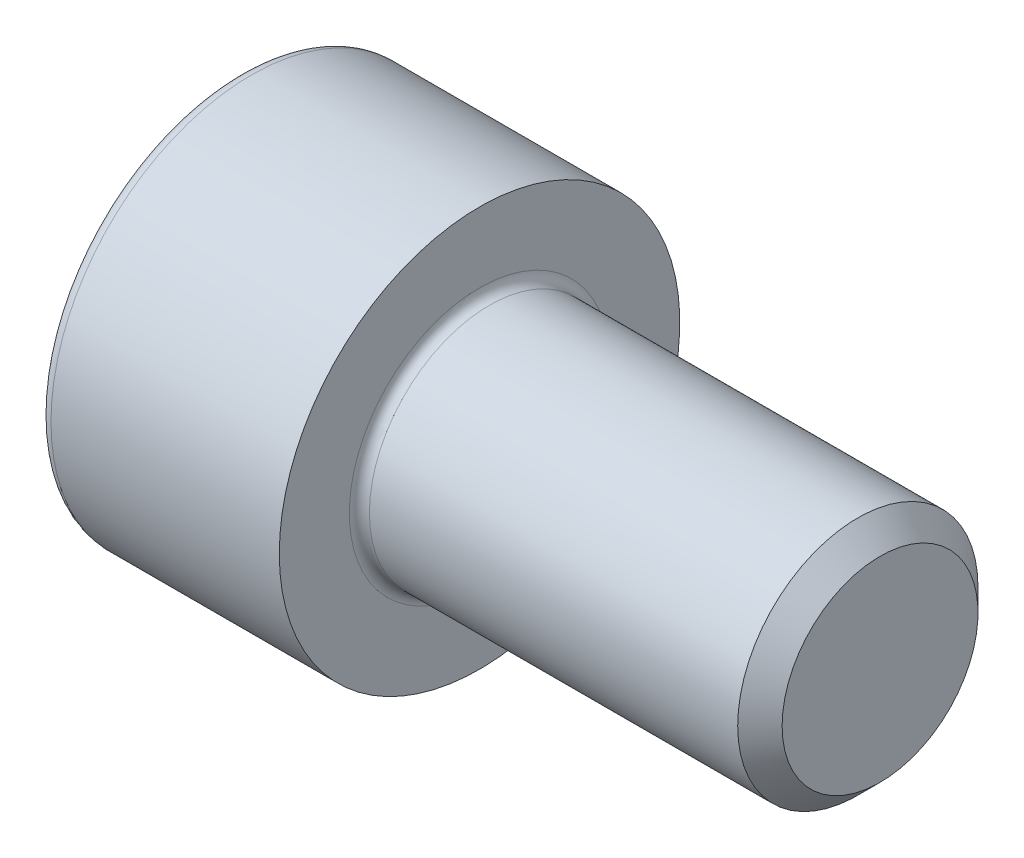
ISO-10303-21;
HEADER;
FILE_DESCRIPTION(('STEP AP214'),'2;1');
FILE_NAME('part.step','',(''),(''),'','','');
FILE_SCHEMA(('AUTOMOTIVE_DESIGN { 1 0 10303 214 1 1 1 1 }'));
ENDSEC;
DATA;
#1=APPLICATION_CONTEXT('core data for automotive mechanical design processes');
#2=APPLICATION_PROTOCOL_DEFINITION('international standard','automotive_design',2000,#1);
#3=PRODUCT_CONTEXT('',#1,'mechanical');
#4=PRODUCT('Part','Part','',(#3));
#5=PRODUCT_RELATED_PRODUCT_CATEGORY('part','',(#4));
#6=PRODUCT_DEFINITION_FORMATION('','',#4);
#7=PRODUCT_DEFINITION_CONTEXT('part definition',#1,'design');
#8=PRODUCT_DEFINITION('design','',#6,#7);
#9=PRODUCT_DEFINITION_SHAPE('','',#8);
#10=(LENGTH_UNIT() NAMED_UNIT(*) SI_UNIT(.MILLI.,.METRE.));
#11=(NAMED_UNIT(*) PLANE_ANGLE_UNIT() SI_UNIT($,.RADIAN.));
#12=(NAMED_UNIT(*) SI_UNIT($,.STERADIAN.) SOLID_ANGLE_UNIT());
#13=UNCERTAINTY_MEASURE_WITH_UNIT(LENGTH_MEASURE(1.E-05),#10,'distance_accuracy_value','');
#14=(GEOMETRIC_REPRESENTATION_CONTEXT(3) GLOBAL_UNCERTAINTY_ASSIGNED_CONTEXT((#13)) GLOBAL_UNIT_ASSIGNED_CONTEXT((#10,
#11,#12)) REPRESENTATION_CONTEXT('',''));
#15=CARTESIAN_POINT('',(0.,0.,0.));
#16=DIRECTION('',(0.,0.,1.));
#17=DIRECTION('',(1.,0.,0.));
#18=AXIS2_PLACEMENT_3D('',#15,#16,#17);
#19=CARTESIAN_POINT('',(0.,0.,0.));
#20=DIRECTION('',(-1.,0.,0.));
#21=DIRECTION('',(0.,0.,1.));
#22=AXIS2_PLACEMENT_3D('',#19,#20,#21);
#23=PLANE('',#22);
#24=DIRECTION('',(0.,-0.5,0.866025403784441));
#25=VECTOR('',#24,1.);
#26=CARTESIAN_POINT('',(0.,2.93524876856011,0.));
#27=LINE('',#26,#25);
#28=CARTESIAN_POINT('',(0.,2.93524876856011,0.));
#29=VERTEX_POINT('',#28);
#30=CARTESIAN_POINT('',(0.,1.46762438428005,2.54200000000002));
#31=VERTEX_POINT('',#30);
#32=EDGE_CURVE('E260',#29,#31,#27,.T.);
#33=ORIENTED_EDGE('',*,*,#32,.T.);
#34=DIRECTION('',(0.,1.,0.));
#35=VECTOR('',#34,1.);
#36=CARTESIAN_POINT('',(0.,-1.46762438428005,2.54200000000002));
#37=LINE('',#36,#35);
#38=CARTESIAN_POINT('',(0.,-1.46762438428005,2.54200000000002));
#39=VERTEX_POINT('',#38);
#40=EDGE_CURVE('E132',#39,#31,#37,.T.);
#41=ORIENTED_EDGE('',*,*,#40,.F.);
#42=DIRECTION('',(0.,-0.500000000000001,-0.86602540378444));
#43=VECTOR('',#42,1.);
#44=CARTESIAN_POINT('',(0.,-1.46762438428005,2.54200000000002));
#45=LINE('',#44,#43);
#46=CARTESIAN_POINT('',(0.,-2.93524876856011,0.));
#47=VERTEX_POINT('',#46);
#48=EDGE_CURVE('E263',#39,#47,#45,.T.);
#49=ORIENTED_EDGE('',*,*,#48,.T.);
#50=DIRECTION('',(0.,0.499999999999999,-0.866025403784441));
#51=VECTOR('',#50,1.);
#52=CARTESIAN_POINT('',(0.,-2.93524876856011,0.));
#53=LINE('',#52,#51);
#54=CARTESIAN_POINT('',(0.,-1.46762438428005,-2.54200000000002));
#55=VERTEX_POINT('',#54);
#56=EDGE_CURVE('E266',#47,#55,#53,.T.);
#57=ORIENTED_EDGE('',*,*,#56,.T.);
#58=DIRECTION('',(0.,-1.,0.));
#59=VECTOR('',#58,1.);
#60=CARTESIAN_POINT('',(0.,1.46762438428005,-2.54200000000002));
#61=LINE('',#60,#59);
#62=CARTESIAN_POINT('',(0.,1.46762438428005,-2.54200000000002));
#63=VERTEX_POINT('',#62);
#64=EDGE_CURVE('E269',#63,#55,#61,.T.);
#65=ORIENTED_EDGE('',*,*,#64,.F.);
#66=DIRECTION('',(0.,-0.500000000000001,-0.86602540378444));
#67=VECTOR('',#66,1.);
#68=CARTESIAN_POINT('',(0.,2.93524876856011,0.));
#69=LINE('',#68,#67);
#70=EDGE_CURVE('E127',#29,#63,#69,.T.);
#71=ORIENTED_EDGE('',*,*,#70,.F.);
#72=EDGE_LOOP('',(#33,#41,#49,#57,#65,#71));
#73=FACE_BOUND('',#72,.T.);
#74=CARTESIAN_POINT('',(0.,0.,0.));
#75=DIRECTION('',(-1.,0.,0.));
#76=DIRECTION('',(0.,0.,1.));
#77=AXIS2_PLACEMENT_3D('',#74,#75,#76);
#78=CIRCLE('',#77,4.7);
#79=CARTESIAN_POINT('',(0.,0.,4.70000000000001));
#80=VERTEX_POINT('',#79);
#81=EDGE_CURVE('E44',#80,#80,#78,.T.);
#82=ORIENTED_EDGE('',*,*,#81,.T.);
#83=EDGE_LOOP('',(#82));
#84=FACE_BOUND('',#83,.T.);
#85=ADVANCED_FACE('F36',(#73,#84),#23,.T.);
#86=CARTESIAN_POINT('',(-31.75,0.,0.));
#87=DIRECTION('',(-1.,0.,0.));
#88=DIRECTION('',(0.,0.,1.));
#89=AXIS2_PLACEMENT_3D('',#86,#87,#88);
#90=CYLINDRICAL_SURFACE('',#89,5.);
#91=CARTESIAN_POINT('',(0.300000000000002,0.,0.));
#92=DIRECTION('',(-1.,0.,0.));
#93=DIRECTION('',(0.,0.,1.));
#94=AXIS2_PLACEMENT_3D('',#91,#92,#93);
#95=CIRCLE('',#94,5.);
#96=CARTESIAN_POINT('',(0.300000000000002,0.,5.00000000000001));
#97=VERTEX_POINT('',#96);
#98=EDGE_CURVE('E11',#97,#97,#95,.F.);
#99=ORIENTED_EDGE('',*,*,#98,.T.);
#100=EDGE_LOOP('',(#99));
#101=FACE_BOUND('',#100,.T.);
#102=CARTESIAN_POINT('',(6.,0.,0.));
#103=DIRECTION('',(-1.,0.,0.));
#104=DIRECTION('',(0.,0.,1.));
#105=AXIS2_PLACEMENT_3D('',#102,#103,#104);
#106=CIRCLE('',#105,5.);
#107=CARTESIAN_POINT('',(6.,0.,5.00000000000001));
#108=VERTEX_POINT('',#107);
#109=EDGE_CURVE('E150',#108,#108,#106,.T.);
#110=ORIENTED_EDGE('',*,*,#109,.T.);
#111=EDGE_LOOP('',(#110));
#112=FACE_BOUND('',#111,.T.);
#113=ADVANCED_FACE('F174',(#101,#112),#90,.T.);
#114=CARTESIAN_POINT('',(6.,5.,0.));
#115=DIRECTION('',(1.,0.,0.));
#116=DIRECTION('',(0.,0.,-1.));
#117=AXIS2_PLACEMENT_3D('',#114,#115,#116);
#118=PLANE('',#117);
#119=CARTESIAN_POINT('',(6.,0.,0.));
#120=DIRECTION('',(1.,0.,0.));
#121=DIRECTION('',(0.,0.,-1.));
#122=AXIS2_PLACEMENT_3D('',#119,#120,#121);
#123=CIRCLE('',#122,3.25);
#124=CARTESIAN_POINT('',(6.,0.,-3.25));
#125=VERTEX_POINT('',#124);
#126=EDGE_CURVE('E153',#125,#125,#123,.F.);
#127=ORIENTED_EDGE('',*,*,#126,.T.);
#128=EDGE_LOOP('',(#127));
#129=FACE_BOUND('',#128,.T.);
#130=ORIENTED_EDGE('',*,*,#109,.F.);
#131=EDGE_LOOP('',(#130));
#132=FACE_BOUND('',#131,.T.);
#133=ADVANCED_FACE('F180',(#129,#132),#118,.T.);
#134=CARTESIAN_POINT('',(-31.75,0.,0.));
#135=DIRECTION('',(-1.,0.,0.));
#136=DIRECTION('',(0.,0.,1.));
#137=AXIS2_PLACEMENT_3D('',#134,#135,#136);
#138=CYLINDRICAL_SURFACE('',#137,3.);
#139=CARTESIAN_POINT('',(6.25,0.,0.));
#140=DIRECTION('',(1.,0.,0.));
#141=DIRECTION('',(0.,0.,-1.));
#142=AXIS2_PLACEMENT_3D('',#139,#140,#141);
#143=CIRCLE('',#142,3.);
#144=CARTESIAN_POINT('',(6.25,0.,-3.));
#145=VERTEX_POINT('',#144);
#146=EDGE_CURVE('E156',#145,#145,#143,.T.);
#147=ORIENTED_EDGE('',*,*,#146,.T.);
#148=EDGE_LOOP('',(#147));
#149=FACE_BOUND('',#148,.T.);
#150=CARTESIAN_POINT('',(15.4455000000001,0.,0.));
#151=DIRECTION('',(-1.,0.,0.));
#152=DIRECTION('',(0.,0.,1.));
#153=AXIS2_PLACEMENT_3D('',#150,#151,#152);
#154=CIRCLE('',#153,3.);
#155=CARTESIAN_POINT('',(15.4455000000001,0.,3.));
#156=VERTEX_POINT('',#155);
#157=EDGE_CURVE('E147',#156,#156,#154,.T.);
#158=ORIENTED_EDGE('',*,*,#157,.T.);
#159=EDGE_LOOP('',(#158));
#160=FACE_BOUND('',#159,.T.);
#161=ADVANCED_FACE('F186',(#149,#160),#138,.T.);
#162=CARTESIAN_POINT('',(16.0000000000001,0.,0.));
#163=DIRECTION('',(-1.,0.,0.));
#164=DIRECTION('',(0.,0.,1.));
#165=AXIS2_PLACEMENT_3D('',#162,#163,#164);
#166=CONICAL_SURFACE('',#165,2.4455,0.78539816339746);
#167=ORIENTED_EDGE('',*,*,#157,.F.);
#168=EDGE_LOOP('',(#167));
#169=FACE_BOUND('',#168,.T.);
#170=CARTESIAN_POINT('',(16.0000000000001,0.,0.));
#171=DIRECTION('',(-1.,0.,0.));
#172=DIRECTION('',(0.,0.,1.));
#173=AXIS2_PLACEMENT_3D('',#170,#171,#172);
#174=CIRCLE('',#173,2.4455);
#175=CARTESIAN_POINT('',(16.0000000000001,0.,2.4455));
#176=VERTEX_POINT('',#175);
#177=EDGE_CURVE('E143',#176,#176,#174,.T.);
#178=ORIENTED_EDGE('',*,*,#177,.T.);
#179=EDGE_LOOP('',(#178));
#180=FACE_BOUND('',#179,.T.);
#181=ADVANCED_FACE('F190',(#169,#180),#166,.T.);
#182=CARTESIAN_POINT('',(16.0000000000001,2.44549999999999,0.));
#183=DIRECTION('',(1.,0.,0.));
#184=DIRECTION('',(0.,0.,-1.));
#185=AXIS2_PLACEMENT_3D('',#182,#183,#184);
#186=PLANE('',#185);
#187=ORIENTED_EDGE('',*,*,#177,.F.);
#188=EDGE_LOOP('',(#187));
#189=FACE_BOUND('',#188,.T.);
#190=ADVANCED_FACE('F170',(#189),#186,.T.);
#191=CARTESIAN_POINT('',(6.25,0.,0.));
#192=DIRECTION('',(1.,0.,0.));
#193=DIRECTION('',(0.,0.,-1.));
#194=AXIS2_PLACEMENT_3D('',#191,#192,#193);
#195=TOROIDAL_SURFACE('',#194,3.25,0.25);
#196=ORIENTED_EDGE('',*,*,#146,.F.);
#197=EDGE_LOOP('',(#196));
#198=FACE_BOUND('',#197,.T.);
#199=ORIENTED_EDGE('',*,*,#126,.F.);
#200=EDGE_LOOP('',(#199));
#201=FACE_BOUND('',#200,.T.);
#202=ADVANCED_FACE('F163',(#198,#201),#195,.F.);
#203=CARTESIAN_POINT('',(0.300000000000002,0.,0.));
#204=DIRECTION('',(-1.,0.,0.));
#205=DIRECTION('',(0.,0.,1.));
#206=AXIS2_PLACEMENT_3D('',#203,#204,#205);
#207=TOROIDAL_SURFACE('',#206,4.7,0.3);
#208=ORIENTED_EDGE('',*,*,#98,.F.);
#209=EDGE_LOOP('',(#208));
#210=FACE_BOUND('',#209,.T.);
#211=ORIENTED_EDGE('',*,*,#81,.F.);
#212=EDGE_LOOP('',(#211));
#213=FACE_BOUND('',#212,.T.);
#214=ADVANCED_FACE('F38',(#210,#213),#207,.T.);
#215=CARTESIAN_POINT('',(3.00000000000002,2.93524876856011,0.));
#216=DIRECTION('',(0.,-0.866025403784439,-0.5));
#217=DIRECTION('',(0.,0.5,-0.866025403784441));
#218=AXIS2_PLACEMENT_3D('',#215,#216,#217);
#219=PLANE('',#218);
#220=ORIENTED_EDGE('',*,*,#32,.F.);
#221=DIRECTION('',(-1.,0.,0.));
#222=VECTOR('',#221,1.);
#223=CARTESIAN_POINT('',(3.00000000000002,2.93524876856011,0.));
#224=LINE('',#223,#222);
#225=CARTESIAN_POINT('',(3.00000000000002,2.93524876856011,0.));
#226=VERTEX_POINT('',#225);
#227=EDGE_CURVE('E250',#226,#29,#224,.T.);
#228=ORIENTED_EDGE('',*,*,#227,.F.);
#229=DIRECTION('',(0.,-0.5,0.866025403784441));
#230=VECTOR('',#229,1.);
#231=CARTESIAN_POINT('',(3.00000000000002,2.93524876856011,0.));
#232=LINE('',#231,#230);
#233=CARTESIAN_POINT('',(2.99999999999999,2.20143657642002,1.27099999999999));
#234=VERTEX_POINT('',#233);
#235=EDGE_CURVE('E119',#226,#234,#232,.T.);
#236=ORIENTED_EDGE('',*,*,#235,.T.);
#237=CARTESIAN_POINT('',(3.00000000000001,1.46762438428005,2.54200000000002));
#238=VERTEX_POINT('',#237);
#239=EDGE_CURVE('E110',#234,#238,#232,.T.);
#240=ORIENTED_EDGE('',*,*,#239,.T.);
#241=DIRECTION('',(-1.,0.,0.));
#242=VECTOR('',#241,1.);
#243=CARTESIAN_POINT('',(3.00000000000001,1.46762438428005,2.54200000000002));
#244=LINE('',#243,#242);
#245=EDGE_CURVE('E124',#238,#31,#244,.T.);
#246=ORIENTED_EDGE('',*,*,#245,.T.);
#247=EDGE_LOOP('',(#220,#228,#236,#240,#246));
#248=FACE_BOUND('',#247,.T.);
#249=ADVANCED_FACE('F123',(#248),#219,.T.);
#250=CARTESIAN_POINT('',(3.00000000000001,-1.46762438428005,2.54200000000002));
#251=DIRECTION('',(0.,0.,1.));
#252=DIRECTION('',(0.,-1.,0.));
#253=AXIS2_PLACEMENT_3D('',#250,#251,#252);
#254=PLANE('',#253);
#255=ORIENTED_EDGE('',*,*,#40,.T.);
#256=ORIENTED_EDGE('',*,*,#245,.F.);
#257=DIRECTION('',(0.,1.,0.));
#258=VECTOR('',#257,1.);
#259=CARTESIAN_POINT('',(3.00000000000001,-1.46762438428005,2.54200000000002));
#260=LINE('',#259,#258);
#261=CARTESIAN_POINT('',(3.,0.,2.54200000000002));
#262=VERTEX_POINT('',#261);
#263=EDGE_CURVE('E107',#262,#238,#260,.T.);
#264=ORIENTED_EDGE('',*,*,#263,.F.);
#265=CARTESIAN_POINT('',(3.00000000000001,-1.46762438428005,2.54200000000002));
#266=VERTEX_POINT('',#265);
#267=EDGE_CURVE('E118',#266,#262,#260,.T.);
#268=ORIENTED_EDGE('',*,*,#267,.F.);
#269=DIRECTION('',(-1.,0.,0.));
#270=VECTOR('',#269,1.);
#271=CARTESIAN_POINT('',(3.00000000000001,-1.46762438428005,2.54200000000002));
#272=LINE('',#271,#270);
#273=EDGE_CURVE('E134',#266,#39,#272,.T.);
#274=ORIENTED_EDGE('',*,*,#273,.T.);
#275=EDGE_LOOP('',(#255,#256,#264,#268,#274));
#276=FACE_BOUND('',#275,.T.);
#277=ADVANCED_FACE('F129',(#276),#254,.F.);
#278=CARTESIAN_POINT('',(3.00000000000001,-1.46762438428005,2.54200000000002));
#279=DIRECTION('',(0.,0.866025403784438,-0.500000000000002));
#280=DIRECTION('',(0.,0.500000000000001,0.86602540378444));
#281=AXIS2_PLACEMENT_3D('',#278,#279,#280);
#282=PLANE('',#281);
#283=ORIENTED_EDGE('',*,*,#48,.F.);
#284=ORIENTED_EDGE('',*,*,#273,.F.);
#285=DIRECTION('',(0.,-0.500000000000001,-0.86602540378444));
#286=VECTOR('',#285,1.);
#287=CARTESIAN_POINT('',(3.00000000000001,-1.46762438428005,2.54200000000002));
#288=LINE('',#287,#286);
#289=CARTESIAN_POINT('',(3.00000000000002,-2.20143657642002,1.27100000000002));
#290=VERTEX_POINT('',#289);
#291=EDGE_CURVE('E289',#266,#290,#288,.T.);
#292=ORIENTED_EDGE('',*,*,#291,.T.);
#293=CARTESIAN_POINT('',(3.,-2.93524876855999,0.));
#294=VERTEX_POINT('',#293);
#295=EDGE_CURVE('E278',#290,#294,#288,.T.);
#296=ORIENTED_EDGE('',*,*,#295,.T.);
#297=DIRECTION('',(-1.,0.,0.));
#298=VECTOR('',#297,1.);
#299=CARTESIAN_POINT('',(3.,-2.93524876855999,0.));
#300=LINE('',#299,#298);
#301=EDGE_CURVE('E139',#294,#47,#300,.T.);
#302=ORIENTED_EDGE('',*,*,#301,.T.);
#303=EDGE_LOOP('',(#283,#284,#292,#296,#302));
#304=FACE_BOUND('',#303,.T.);
#305=ADVANCED_FACE('F204',(#304),#282,.T.);
#306=CARTESIAN_POINT('',(3.,-2.93524876855999,0.));
#307=DIRECTION('',(0.,0.866025403784439,0.5));
#308=DIRECTION('',(0.,-0.499999999999999,0.866025403784441));
#309=AXIS2_PLACEMENT_3D('',#306,#307,#308);
#310=PLANE('',#309);
#311=ORIENTED_EDGE('',*,*,#56,.F.);
#312=ORIENTED_EDGE('',*,*,#301,.F.);
#313=DIRECTION('',(0.,0.499999999999999,-0.866025403784441));
#314=VECTOR('',#313,1.);
#315=CARTESIAN_POINT('',(3.,-2.93524876855999,0.));
#316=LINE('',#315,#314);
#317=CARTESIAN_POINT('',(3.,-2.20143657642002,-1.27100000000002));
#318=VERTEX_POINT('',#317);
#319=EDGE_CURVE('E256',#294,#318,#316,.T.);
#320=ORIENTED_EDGE('',*,*,#319,.T.);
#321=CARTESIAN_POINT('',(3.,-1.46762438428005,-2.54200000000002));
#322=VERTEX_POINT('',#321);
#323=EDGE_CURVE('E288',#318,#322,#316,.T.);
#324=ORIENTED_EDGE('',*,*,#323,.T.);
#325=DIRECTION('',(-1.,0.,0.));
#326=VECTOR('',#325,1.);
#327=CARTESIAN_POINT('',(3.,-1.46762438428005,-2.54200000000002));
#328=LINE('',#327,#326);
#329=EDGE_CURVE('E249',#322,#55,#328,.T.);
#330=ORIENTED_EDGE('',*,*,#329,.T.);
#331=EDGE_LOOP('',(#311,#312,#320,#324,#330));
#332=FACE_BOUND('',#331,.T.);
#333=ADVANCED_FACE('F207',(#332),#310,.T.);
#334=CARTESIAN_POINT('',(3.00000000000001,1.46762438428005,-2.54200000000002));
#335=DIRECTION('',(0.,0.,-1.));
#336=DIRECTION('',(0.,1.,0.));
#337=AXIS2_PLACEMENT_3D('',#334,#335,#336);
#338=PLANE('',#337);
#339=ORIENTED_EDGE('',*,*,#64,.T.);
#340=ORIENTED_EDGE('',*,*,#329,.F.);
#341=DIRECTION('',(0.,-1.,0.));
#342=VECTOR('',#341,1.);
#343=CARTESIAN_POINT('',(3.00000000000001,1.46762438428005,-2.54200000000002));
#344=LINE('',#343,#342);
#345=CARTESIAN_POINT('',(2.99999999999998,0.,-2.54200000000002));
#346=VERTEX_POINT('',#345);
#347=EDGE_CURVE('E253',#346,#322,#344,.T.);
#348=ORIENTED_EDGE('',*,*,#347,.F.);
#349=CARTESIAN_POINT('',(3.00000000000001,1.46762438428005,-2.54200000000002));
#350=VERTEX_POINT('',#349);
#351=EDGE_CURVE('E51',#350,#346,#344,.T.);
#352=ORIENTED_EDGE('',*,*,#351,.F.);
#353=DIRECTION('',(-1.,0.,0.));
#354=VECTOR('',#353,1.);
#355=CARTESIAN_POINT('',(3.00000000000001,1.46762438428005,-2.54200000000002));
#356=LINE('',#355,#354);
#357=EDGE_CURVE('E246',#350,#63,#356,.T.);
#358=ORIENTED_EDGE('',*,*,#357,.T.);
#359=EDGE_LOOP('',(#339,#340,#348,#352,#358));
#360=FACE_BOUND('',#359,.T.);
#361=ADVANCED_FACE('F211',(#360),#338,.F.);
#362=CARTESIAN_POINT('',(3.00000000000002,2.93524876856011,0.));
#363=DIRECTION('',(0.,0.866025403784438,-0.500000000000002));
#364=DIRECTION('',(0.,0.500000000000001,0.86602540378444));
#365=AXIS2_PLACEMENT_3D('',#362,#363,#364);
#366=PLANE('',#365);
#367=ORIENTED_EDGE('',*,*,#70,.T.);
#368=ORIENTED_EDGE('',*,*,#357,.F.);
#369=DIRECTION('',(0.,-0.500000000000001,-0.86602540378444));
#370=VECTOR('',#369,1.);
#371=CARTESIAN_POINT('',(3.00000000000002,2.93524876856011,0.));
#372=LINE('',#371,#370);
#373=CARTESIAN_POINT('',(2.99999999999999,2.20143657642002,-1.27100000000002));
#374=VERTEX_POINT('',#373);
#375=EDGE_CURVE('E236',#374,#350,#372,.T.);
#376=ORIENTED_EDGE('',*,*,#375,.F.);
#377=EDGE_CURVE('E242',#226,#374,#372,.T.);
#378=ORIENTED_EDGE('',*,*,#377,.F.);
#379=ORIENTED_EDGE('',*,*,#227,.T.);
#380=EDGE_LOOP('',(#367,#368,#376,#378,#379));
#381=FACE_BOUND('',#380,.T.);
#382=ADVANCED_FACE('F215',(#381),#366,.F.);
#383=CARTESIAN_POINT('',(3.00000000000002,2.93524876856011,0.));
#384=DIRECTION('',(1.,0.,0.));
#385=DIRECTION('',(0.,0.,-1.));
#386=AXIS2_PLACEMENT_3D('',#383,#384,#385);
#387=PLANE('',#386);
#388=ORIENTED_EDGE('',*,*,#347,.T.);
#389=ORIENTED_EDGE('',*,*,#323,.F.);
#390=CARTESIAN_POINT('',(3.,0.,0.));
#391=DIRECTION('',(-1.,0.,0.));
#392=DIRECTION('',(0.,0.,1.));
#393=AXIS2_PLACEMENT_3D('',#390,#391,#392);
#394=CIRCLE('',#393,2.542);
#395=EDGE_CURVE('E284',#346,#318,#394,.T.);
#396=ORIENTED_EDGE('',*,*,#395,.F.);
#397=EDGE_LOOP('',(#388,#389,#396));
#398=FACE_BOUND('',#397,.T.);
#399=ADVANCED_FACE('F219',(#398),#387,.F.);
#400=ORIENTED_EDGE('',*,*,#319,.F.);
#401=ORIENTED_EDGE('',*,*,#295,.F.);
#402=EDGE_CURVE('E137',#318,#290,#394,.T.);
#403=ORIENTED_EDGE('',*,*,#402,.F.);
#404=EDGE_LOOP('',(#400,#401,#403));
#405=FACE_BOUND('',#404,.T.);
#406=ADVANCED_FACE('F222',(#405),#387,.F.);
#407=ORIENTED_EDGE('',*,*,#291,.F.);
#408=ORIENTED_EDGE('',*,*,#267,.T.);
#409=EDGE_CURVE('E133',#290,#262,#394,.T.);
#410=ORIENTED_EDGE('',*,*,#409,.F.);
#411=EDGE_LOOP('',(#407,#408,#410));
#412=FACE_BOUND('',#411,.T.);
#413=ADVANCED_FACE('F227',(#412),#387,.F.);
#414=ORIENTED_EDGE('',*,*,#263,.T.);
#415=ORIENTED_EDGE('',*,*,#239,.F.);
#416=EDGE_CURVE('E113',#262,#234,#394,.T.);
#417=ORIENTED_EDGE('',*,*,#416,.F.);
#418=EDGE_LOOP('',(#414,#415,#417));
#419=FACE_BOUND('',#418,.T.);
#420=ADVANCED_FACE('F109',(#419),#387,.F.);
#421=ORIENTED_EDGE('',*,*,#235,.F.);
#422=ORIENTED_EDGE('',*,*,#377,.T.);
#423=EDGE_CURVE('E144',#234,#374,#394,.T.);
#424=ORIENTED_EDGE('',*,*,#423,.F.);
#425=EDGE_LOOP('',(#421,#422,#424));
#426=FACE_BOUND('',#425,.T.);
#427=ADVANCED_FACE('F230',(#426),#387,.F.);
#428=ORIENTED_EDGE('',*,*,#375,.T.);
#429=ORIENTED_EDGE('',*,*,#351,.T.);
#430=EDGE_CURVE('E239',#374,#346,#394,.T.);
#431=ORIENTED_EDGE('',*,*,#430,.F.);
#432=EDGE_LOOP('',(#428,#429,#431));
#433=FACE_BOUND('',#432,.T.);
#434=ADVANCED_FACE('F200',(#433),#387,.F.);
#435=CARTESIAN_POINT('',(3.,0.,0.));
#436=DIRECTION('',(-1.,0.,0.));
#437=DIRECTION('',(0.,0.,1.));
#438=AXIS2_PLACEMENT_3D('',#435,#436,#437);
#439=CONICAL_SURFACE('',#438,2.542,1.04719755119659);
#440=CARTESIAN_POINT('',(4.46762438428005,0.,0.));
#441=VERTEX_POINT('',#440);
#442=VERTEX_LOOP('',#441);
#443=FACE_BOUND('',#442,.T.);
#444=ORIENTED_EDGE('',*,*,#416,.T.);
#445=ORIENTED_EDGE('',*,*,#423,.T.);
#446=ORIENTED_EDGE('',*,*,#430,.T.);
#447=ORIENTED_EDGE('',*,*,#395,.T.);
#448=ORIENTED_EDGE('',*,*,#402,.T.);
#449=ORIENTED_EDGE('',*,*,#409,.T.);
#450=EDGE_LOOP('',(#444,#445,#446,#447,#448,#449));
#451=FACE_BOUND('',#450,.T.);
#452=ADVANCED_FACE('F198',(#443,#451),#439,.F.);
#453=CLOSED_SHELL('',(#85,#113,#133,#161,#181,#190,#202,#214,#249,#277,#305,#333,#361,#382,#399,
#406,#413,#420,#427,#434,#452));
#454=MANIFOLD_SOLID_BREP('B2',#453);
#455=ADVANCED_BREP_SHAPE_REPRESENTATION('',(#18,#454),#14);
#456=SHAPE_DEFINITION_REPRESENTATION(#9,#455);
ENDSEC;
END-ISO-10303-21;
